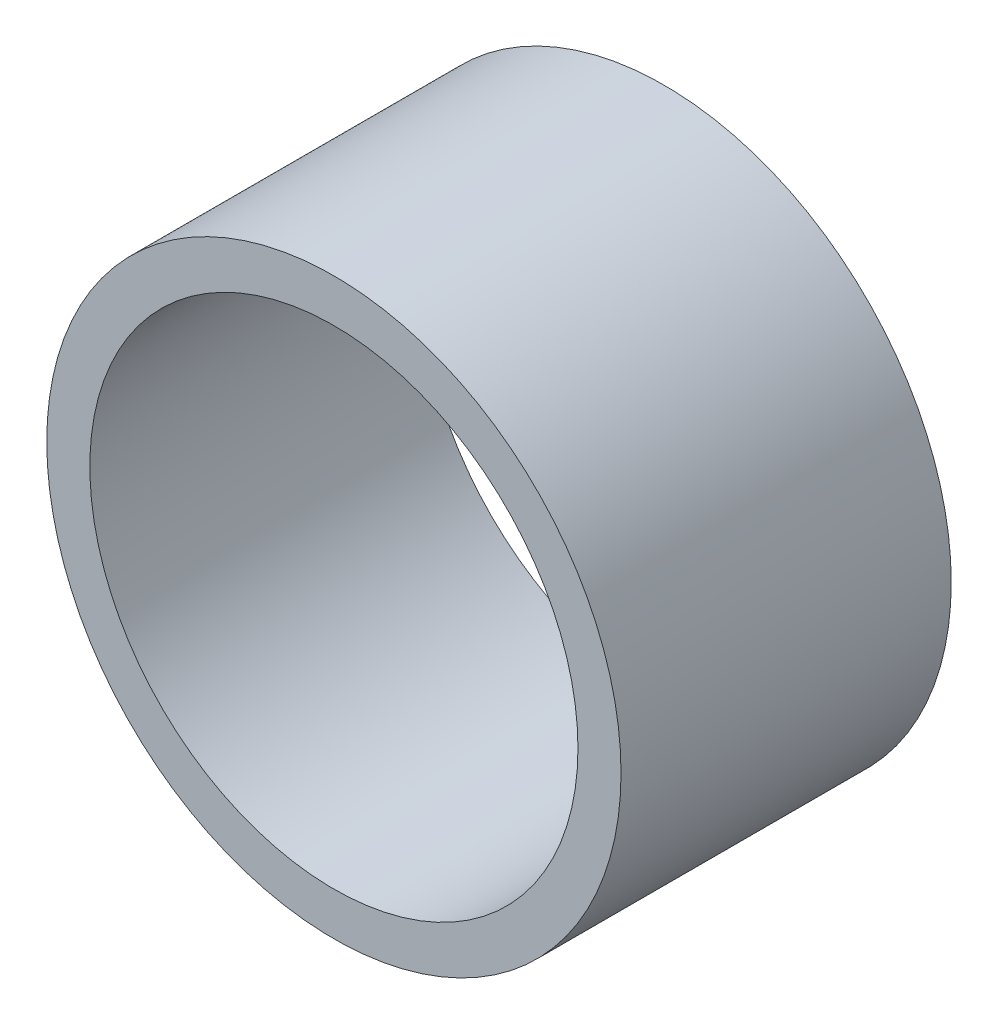
ISO-10303-21;
HEADER;
FILE_DESCRIPTION(('STEP AP214'),'2;1');
FILE_NAME('part.step','',(''),(''),'','','');
FILE_SCHEMA(('AUTOMOTIVE_DESIGN { 1 0 10303 214 1 1 1 1 }'));
ENDSEC;
DATA;
#1=APPLICATION_CONTEXT('core data for automotive mechanical design processes');
#2=APPLICATION_PROTOCOL_DEFINITION('international standard','automotive_design',2000,#1);
#3=PRODUCT_CONTEXT('',#1,'mechanical');
#4=PRODUCT('Part','Part','',(#3));
#5=PRODUCT_RELATED_PRODUCT_CATEGORY('part','',(#4));
#6=PRODUCT_DEFINITION_FORMATION('','',#4);
#7=PRODUCT_DEFINITION_CONTEXT('part definition',#1,'design');
#8=PRODUCT_DEFINITION('design','',#6,#7);
#9=PRODUCT_DEFINITION_SHAPE('','',#8);
#10=(LENGTH_UNIT() NAMED_UNIT(*) SI_UNIT(.MILLI.,.METRE.));
#11=(NAMED_UNIT(*) PLANE_ANGLE_UNIT() SI_UNIT($,.RADIAN.));
#12=(NAMED_UNIT(*) SI_UNIT($,.STERADIAN.) SOLID_ANGLE_UNIT());
#13=UNCERTAINTY_MEASURE_WITH_UNIT(LENGTH_MEASURE(1.E-05),#10,'distance_accuracy_value','');
#14=(GEOMETRIC_REPRESENTATION_CONTEXT(3) GLOBAL_UNCERTAINTY_ASSIGNED_CONTEXT((#13)) GLOBAL_UNIT_ASSIGNED_CONTEXT((#10,
#11,#12)) REPRESENTATION_CONTEXT('',''));
#15=CARTESIAN_POINT('',(0.,0.,0.));
#16=DIRECTION('',(0.,0.,1.));
#17=DIRECTION('',(1.,0.,0.));
#18=AXIS2_PLACEMENT_3D('',#15,#16,#17);
#19=CARTESIAN_POINT('',(0.,0.,17.));
#20=DIRECTION('',(0.,0.,1.));
#21=DIRECTION('',(1.,0.,0.));
#22=AXIS2_PLACEMENT_3D('',#19,#20,#21);
#23=PLANE('',#22);
#24=CARTESIAN_POINT('',(0.,0.,17.));
#25=DIRECTION('',(0.,0.,1.));
#26=DIRECTION('',(1.,0.,0.));
#27=AXIS2_PLACEMENT_3D('',#24,#25,#26);
#28=CIRCLE('',#27,15.);
#29=CARTESIAN_POINT('',(15.,0.,17.));
#30=VERTEX_POINT('',#29);
#31=EDGE_CURVE('E11',#30,#30,#28,.T.);
#32=ORIENTED_EDGE('',*,*,#31,.T.);
#33=EDGE_LOOP('',(#32));
#34=FACE_BOUND('',#33,.T.);
#35=CARTESIAN_POINT('',(0.,0.,17.));
#36=DIRECTION('',(0.,0.,1.));
#37=DIRECTION('',(1.,0.,0.));
#38=AXIS2_PLACEMENT_3D('',#35,#36,#37);
#39=CIRCLE('',#38,12.75);
#40=CARTESIAN_POINT('',(12.75,0.,17.));
#41=VERTEX_POINT('',#40);
#42=EDGE_CURVE('E41',#41,#41,#39,.T.);
#43=ORIENTED_EDGE('',*,*,#42,.F.);
#44=EDGE_LOOP('',(#43));
#45=FACE_BOUND('',#44,.T.);
#46=ADVANCED_FACE('F33',(#34,#45),#23,.T.);
#47=CARTESIAN_POINT('',(0.,0.,17.));
#48=DIRECTION('',(0.,0.,-1.));
#49=DIRECTION('',(-1.,0.,0.));
#50=AXIS2_PLACEMENT_3D('',#47,#48,#49);
#51=CYLINDRICAL_SURFACE('',#50,15.);
#52=ORIENTED_EDGE('',*,*,#31,.F.);
#53=EDGE_LOOP('',(#52));
#54=FACE_BOUND('',#53,.T.);
#55=CARTESIAN_POINT('',(0.,0.,-0.25));
#56=DIRECTION('',(0.,0.,1.));
#57=DIRECTION('',(1.,0.,0.));
#58=AXIS2_PLACEMENT_3D('',#55,#56,#57);
#59=CIRCLE('',#58,15.);
#60=CARTESIAN_POINT('',(15.,0.,-0.25));
#61=VERTEX_POINT('',#60);
#62=EDGE_CURVE('E490',#61,#61,#59,.T.);
#63=ORIENTED_EDGE('',*,*,#62,.T.);
#64=EDGE_LOOP('',(#63));
#65=FACE_BOUND('',#64,.T.);
#66=ADVANCED_FACE('F35',(#54,#65),#51,.T.);
#67=CARTESIAN_POINT('',(0.,0.,17.));
#68=DIRECTION('',(0.,0.,-1.));
#69=DIRECTION('',(-1.,0.,0.));
#70=AXIS2_PLACEMENT_3D('',#67,#68,#69);
#71=CYLINDRICAL_SURFACE('',#70,12.75);
#72=ORIENTED_EDGE('',*,*,#42,.T.);
#73=EDGE_LOOP('',(#72));
#74=FACE_BOUND('',#73,.T.);
#75=CARTESIAN_POINT('',(0.,0.,0.));
#76=DIRECTION('',(0.,0.,1.));
#77=DIRECTION('',(1.,0.,0.));
#78=AXIS2_PLACEMENT_3D('',#75,#76,#77);
#79=CIRCLE('',#78,12.75);
#80=CARTESIAN_POINT('',(-12.7401923062409,0.5,0.));
#81=VERTEX_POINT('',#80);
#82=CARTESIAN_POINT('',(-12.7401923062409,-0.499999999999999,0.));
#83=VERTEX_POINT('',#82);
#84=EDGE_CURVE('E56',#81,#83,#79,.T.);
#85=ORIENTED_EDGE('',*,*,#84,.F.);
#86=DIRECTION('',(0.,0.,1.));
#87=VECTOR('',#86,1.);
#88=CARTESIAN_POINT('',(-12.7401923062409,0.5,-0.25));
#89=LINE('',#88,#87);
#90=CARTESIAN_POINT('',(-12.7401923062409,0.5,-0.25));
#91=VERTEX_POINT('',#90);
#92=EDGE_CURVE('E495',#91,#81,#89,.T.);
#93=ORIENTED_EDGE('',*,*,#92,.F.);
#94=CARTESIAN_POINT('',(0.,0.,-0.25));
#95=DIRECTION('',(0.,0.,1.));
#96=DIRECTION('',(-1.,0.,0.));
#97=AXIS2_PLACEMENT_3D('',#94,#95,#96);
#98=CIRCLE('',#97,12.75);
#99=CARTESIAN_POINT('',(12.7401923062409,0.500000000000003,-0.25));
#100=VERTEX_POINT('',#99);
#101=EDGE_CURVE('E457',#100,#91,#98,.T.);
#102=ORIENTED_EDGE('',*,*,#101,.F.);
#103=DIRECTION('',(0.,0.,1.));
#104=VECTOR('',#103,1.);
#105=CARTESIAN_POINT('',(12.7401923062409,0.500000000000003,-0.25));
#106=LINE('',#105,#104);
#107=CARTESIAN_POINT('',(12.7401923062409,0.500000000000003,0.));
#108=VERTEX_POINT('',#107);
#109=EDGE_CURVE('E498',#100,#108,#106,.T.);
#110=ORIENTED_EDGE('',*,*,#109,.T.);
#111=CARTESIAN_POINT('',(12.7401923062409,-0.499999999999997,0.));
#112=VERTEX_POINT('',#111);
#113=EDGE_CURVE('E48',#112,#108,#79,.T.);
#114=ORIENTED_EDGE('',*,*,#113,.F.);
#115=DIRECTION('',(0.,0.,1.));
#116=VECTOR('',#115,1.);
#117=CARTESIAN_POINT('',(12.7401923062409,-0.499999999999997,-0.25));
#118=LINE('',#117,#116);
#119=CARTESIAN_POINT('',(12.7401923062409,-0.499999999999997,-0.25));
#120=VERTEX_POINT('',#119);
#121=EDGE_CURVE('E309',#120,#112,#118,.T.);
#122=ORIENTED_EDGE('',*,*,#121,.F.);
#123=CARTESIAN_POINT('',(0.,0.,-0.25));
#124=DIRECTION('',(0.,0.,1.));
#125=DIRECTION('',(1.,0.,0.));
#126=AXIS2_PLACEMENT_3D('',#123,#124,#125);
#127=CIRCLE('',#126,12.75);
#128=CARTESIAN_POINT('',(-12.7401923062409,-0.499999999999999,-0.25));
#129=VERTEX_POINT('',#128);
#130=EDGE_CURVE('E279',#129,#120,#127,.T.);
#131=ORIENTED_EDGE('',*,*,#130,.F.);
#132=DIRECTION('',(0.,0.,1.));
#133=VECTOR('',#132,1.);
#134=CARTESIAN_POINT('',(-12.7401923062409,-0.499999999999999,-0.25));
#135=LINE('',#134,#133);
#136=EDGE_CURVE('E311',#129,#83,#135,.T.);
#137=ORIENTED_EDGE('',*,*,#136,.T.);
#138=EDGE_LOOP('',(#85,#93,#102,#110,#114,#122,#131,#137));
#139=FACE_BOUND('',#138,.T.);
#140=ADVANCED_FACE('F515',(#74,#139),#71,.F.);
#141=CARTESIAN_POINT('',(0.,0.,0.));
#142=DIRECTION('',(0.,0.,1.));
#143=DIRECTION('',(1.,0.,0.));
#144=AXIS2_PLACEMENT_3D('',#141,#142,#143);
#145=PLANE('',#144);
#146=CARTESIAN_POINT('',(0.,0.,0.));
#147=DIRECTION('',(0.,0.,-1.));
#148=DIRECTION('',(1.,0.,0.));
#149=AXIS2_PLACEMENT_3D('',#146,#147,#148);
#150=CIRCLE('',#149,5.);
#151=CARTESIAN_POINT('',(-0.499999999999998,-4.9749371855331,0.));
#152=VERTEX_POINT('',#151);
#153=CARTESIAN_POINT('',(-0.499999999999998,4.9749371855331,0.));
#154=VERTEX_POINT('',#153);
#155=EDGE_CURVE('E365',#152,#154,#150,.T.);
#156=ORIENTED_EDGE('',*,*,#155,.F.);
#157=DIRECTION('',(0.,1.,0.));
#158=VECTOR('',#157,1.);
#159=CARTESIAN_POINT('',(-0.499999999999998,-4.9749371855331,0.));
#160=LINE('',#159,#158);
#161=CARTESIAN_POINT('',(-0.499999999999997,-8.86090429922364,0.));
#162=VERTEX_POINT('',#161);
#163=EDGE_CURVE('E384',#162,#152,#160,.T.);
#164=ORIENTED_EDGE('',*,*,#163,.F.);
#165=DIRECTION('',(1.,0.,0.));
#166=VECTOR('',#165,1.);
#167=CARTESIAN_POINT('',(-0.499999999999997,-8.86090429922364,0.));
#168=LINE('',#167,#166);
#169=CARTESIAN_POINT('',(-0.999999999999997,-8.86090429922364,0.));
#170=VERTEX_POINT('',#169);
#171=EDGE_CURVE('E422',#170,#162,#168,.T.);
#172=ORIENTED_EDGE('',*,*,#171,.F.);
#173=DIRECTION('',(0.,-1.,0.));
#174=VECTOR('',#173,1.);
#175=CARTESIAN_POINT('',(-0.999999999999997,-8.86090429922364,0.));
#176=LINE('',#175,#174);
#177=CARTESIAN_POINT('',(-1.,-7.30688887283774,0.));
#178=VERTEX_POINT('',#177);
#179=EDGE_CURVE('E419',#178,#170,#176,.T.);
#180=ORIENTED_EDGE('',*,*,#179,.F.);
#181=CARTESIAN_POINT('',(0.,0.,0.));
#182=DIRECTION('',(0.,0.,1.));
#183=DIRECTION('',(1.,0.,0.));
#184=AXIS2_PLACEMENT_3D('',#181,#182,#183);
#185=CIRCLE('',#184,7.375);
#186=CARTESIAN_POINT('',(-0.999999999999997,7.30688887283774,0.));
#187=VERTEX_POINT('',#186);
#188=EDGE_CURVE('E416',#187,#178,#185,.T.);
#189=ORIENTED_EDGE('',*,*,#188,.F.);
#190=DIRECTION('',(0.,-1.,0.));
#191=VECTOR('',#190,1.);
#192=CARTESIAN_POINT('',(-0.999999999999999,8.86090429922364,0.));
#193=LINE('',#192,#191);
#194=CARTESIAN_POINT('',(-0.999999999999999,8.86090429922364,0.));
#195=VERTEX_POINT('',#194);
#196=EDGE_CURVE('E413',#195,#187,#193,.T.);
#197=ORIENTED_EDGE('',*,*,#196,.F.);
#198=DIRECTION('',(-1.,0.,0.));
#199=VECTOR('',#198,1.);
#200=CARTESIAN_POINT('',(-0.499999999999999,8.86090429922364,0.));
#201=LINE('',#200,#199);
#202=CARTESIAN_POINT('',(-0.499999999999999,8.86090429922364,0.));
#203=VERTEX_POINT('',#202);
#204=EDGE_CURVE('E410',#203,#195,#201,.T.);
#205=ORIENTED_EDGE('',*,*,#204,.F.);
#206=DIRECTION('',(0.,1.,0.));
#207=VECTOR('',#206,1.);
#208=CARTESIAN_POINT('',(-0.499999999999998,4.9749371855331,0.));
#209=LINE('',#208,#207);
#210=EDGE_CURVE('E407',#154,#203,#209,.T.);
#211=ORIENTED_EDGE('',*,*,#210,.F.);
#212=EDGE_LOOP('',(#156,#164,#172,#180,#189,#197,#205,#211));
#213=FACE_BOUND('',#212,.T.);
#214=CARTESIAN_POINT('',(0.,0.,0.));
#215=DIRECTION('',(0.,0.,-1.));
#216=DIRECTION('',(-1.,0.,0.));
#217=AXIS2_PLACEMENT_3D('',#214,#215,#216);
#218=CIRCLE('',#217,4.99999999999486);
#219=CARTESIAN_POINT('',(0.499999999999999,4.97493718552794,0.));
#220=VERTEX_POINT('',#219);
#221=CARTESIAN_POINT('',(0.499999999999998,-4.97493718552794,0.));
#222=VERTEX_POINT('',#221);
#223=EDGE_CURVE('E304',#220,#222,#218,.T.);
#224=ORIENTED_EDGE('',*,*,#223,.F.);
#225=DIRECTION('',(0.,-1.,0.));
#226=VECTOR('',#225,1.);
#227=CARTESIAN_POINT('',(0.500000000000001,8.86090429922364,0.));
#228=LINE('',#227,#226);
#229=CARTESIAN_POINT('',(0.500000000000001,8.86090429922364,0.));
#230=VERTEX_POINT('',#229);
#231=EDGE_CURVE('E320',#230,#220,#228,.T.);
#232=ORIENTED_EDGE('',*,*,#231,.F.);
#233=DIRECTION('',(-1.,0.,0.));
#234=VECTOR('',#233,1.);
#235=CARTESIAN_POINT('',(1.,8.86090429922364,0.));
#236=LINE('',#235,#234);
#237=CARTESIAN_POINT('',(1.,8.86090429922364,0.));
#238=VERTEX_POINT('',#237);
#239=EDGE_CURVE('E358',#238,#230,#236,.T.);
#240=ORIENTED_EDGE('',*,*,#239,.F.);
#241=DIRECTION('',(0.,1.,0.));
#242=VECTOR('',#241,1.);
#243=CARTESIAN_POINT('',(0.999999999999999,7.30688887284244,0.));
#244=LINE('',#243,#242);
#245=CARTESIAN_POINT('',(0.999999999999999,7.30688887284244,0.));
#246=VERTEX_POINT('',#245);
#247=EDGE_CURVE('E355',#246,#238,#244,.T.);
#248=ORIENTED_EDGE('',*,*,#247,.F.);
#249=CARTESIAN_POINT('',(0.,0.,0.));
#250=DIRECTION('',(0.,0.,1.));
#251=DIRECTION('',(-1.,0.,0.));
#252=AXIS2_PLACEMENT_3D('',#249,#250,#251);
#253=CIRCLE('',#252,7.37500000000465);
#254=CARTESIAN_POINT('',(0.999999999999996,-7.30688887284244,0.));
#255=VERTEX_POINT('',#254);
#256=EDGE_CURVE('E352',#255,#246,#253,.T.);
#257=ORIENTED_EDGE('',*,*,#256,.F.);
#258=DIRECTION('',(0.,1.,0.));
#259=VECTOR('',#258,1.);
#260=CARTESIAN_POINT('',(1.,-8.86090429922364,0.));
#261=LINE('',#260,#259);
#262=CARTESIAN_POINT('',(1.,-8.86090429922364,0.));
#263=VERTEX_POINT('',#262);
#264=EDGE_CURVE('E349',#263,#255,#261,.T.);
#265=ORIENTED_EDGE('',*,*,#264,.F.);
#266=DIRECTION('',(1.,0.,0.));
#267=VECTOR('',#266,1.);
#268=CARTESIAN_POINT('',(0.499999999999997,-8.86090429922364,0.));
#269=LINE('',#268,#267);
#270=CARTESIAN_POINT('',(0.499999999999997,-8.86090429922364,0.));
#271=VERTEX_POINT('',#270);
#272=EDGE_CURVE('E346',#271,#263,#269,.T.);
#273=ORIENTED_EDGE('',*,*,#272,.F.);
#274=DIRECTION('',(0.,-1.,0.));
#275=VECTOR('',#274,1.);
#276=CARTESIAN_POINT('',(0.499999999999998,-4.97493718552794,0.));
#277=LINE('',#276,#275);
#278=EDGE_CURVE('E343',#222,#271,#277,.T.);
#279=ORIENTED_EDGE('',*,*,#278,.F.);
#280=EDGE_LOOP('',(#224,#232,#240,#248,#257,#265,#273,#279));
#281=FACE_BOUND('',#280,.T.);
#282=DIRECTION('',(1.,0.,0.));
#283=VECTOR('',#282,1.);
#284=CARTESIAN_POINT('',(-12.7401923062409,0.5,0.));
#285=LINE('',#284,#283);
#286=CARTESIAN_POINT('',(-8.86090429922364,0.5,0.));
#287=VERTEX_POINT('',#286);
#288=EDGE_CURVE('E480',#81,#287,#285,.T.);
#289=ORIENTED_EDGE('',*,*,#288,.F.);
#290=ORIENTED_EDGE('',*,*,#84,.T.);
#291=DIRECTION('',(-1.,0.,0.));
#292=VECTOR('',#291,1.);
#293=CARTESIAN_POINT('',(-12.7401923062409,-0.5,0.));
#294=LINE('',#293,#292);
#295=CARTESIAN_POINT('',(-8.86090429922364,-0.5,0.));
#296=VERTEX_POINT('',#295);
#297=EDGE_CURVE('E294',#296,#83,#294,.T.);
#298=ORIENTED_EDGE('',*,*,#297,.F.);
#299=DIRECTION('',(0.,1.,0.));
#300=VECTOR('',#299,1.);
#301=CARTESIAN_POINT('',(-8.86090429922364,-0.5,0.));
#302=LINE('',#301,#300);
#303=CARTESIAN_POINT('',(-8.86090429922364,-1.,0.));
#304=VERTEX_POINT('',#303);
#305=EDGE_CURVE('E291',#304,#296,#302,.T.);
#306=ORIENTED_EDGE('',*,*,#305,.F.);
#307=DIRECTION('',(1.,0.,0.));
#308=VECTOR('',#307,1.);
#309=CARTESIAN_POINT('',(-8.86090429922364,-1.,0.));
#310=LINE('',#309,#308);
#311=CARTESIAN_POINT('',(-10.3266947761614,-1.,0.));
#312=VERTEX_POINT('',#311);
#313=EDGE_CURVE('E289',#312,#304,#310,.T.);
#314=ORIENTED_EDGE('',*,*,#313,.F.);
#315=CARTESIAN_POINT('',(0.,0.,0.));
#316=DIRECTION('',(0.,0.,-1.));
#317=DIRECTION('',(-1.,0.,0.));
#318=AXIS2_PLACEMENT_3D('',#315,#316,#317);
#319=CIRCLE('',#318,10.375);
#320=CARTESIAN_POINT('',(10.3266947761614,-0.999999999999997,0.));
#321=VERTEX_POINT('',#320);
#322=EDGE_CURVE('E250',#321,#312,#319,.T.);
#323=ORIENTED_EDGE('',*,*,#322,.F.);
#324=DIRECTION('',(1.,0.,0.));
#325=VECTOR('',#324,1.);
#326=CARTESIAN_POINT('',(8.86090429922364,-0.999999999999998,0.));
#327=LINE('',#326,#325);
#328=CARTESIAN_POINT('',(8.86090429922364,-0.999999999999998,0.));
#329=VERTEX_POINT('',#328);
#330=EDGE_CURVE('E269',#329,#321,#327,.T.);
#331=ORIENTED_EDGE('',*,*,#330,.F.);
#332=DIRECTION('',(0.,-1.,0.));
#333=VECTOR('',#332,1.);
#334=CARTESIAN_POINT('',(8.86090429922364,-0.5,0.));
#335=LINE('',#334,#333);
#336=CARTESIAN_POINT('',(8.86090429922364,-0.5,0.));
#337=VERTEX_POINT('',#336);
#338=EDGE_CURVE('E272',#337,#329,#335,.T.);
#339=ORIENTED_EDGE('',*,*,#338,.F.);
#340=DIRECTION('',(-1.,0.,0.));
#341=VECTOR('',#340,1.);
#342=CARTESIAN_POINT('',(12.7401923062409,-0.499999999999997,0.));
#343=LINE('',#342,#341);
#344=EDGE_CURVE('E297',#112,#337,#343,.T.);
#345=ORIENTED_EDGE('',*,*,#344,.F.);
#346=ORIENTED_EDGE('',*,*,#113,.T.);
#347=DIRECTION('',(1.,0.,0.));
#348=VECTOR('',#347,1.);
#349=CARTESIAN_POINT('',(12.7401923062409,0.500000000000003,0.));
#350=LINE('',#349,#348);
#351=CARTESIAN_POINT('',(8.86090429922364,0.5,0.));
#352=VERTEX_POINT('',#351);
#353=EDGE_CURVE('E477',#352,#108,#350,.T.);
#354=ORIENTED_EDGE('',*,*,#353,.F.);
#355=DIRECTION('',(0.,-1.,0.));
#356=VECTOR('',#355,1.);
#357=CARTESIAN_POINT('',(8.86090429922364,0.5,0.));
#358=LINE('',#357,#356);
#359=CARTESIAN_POINT('',(8.86090429922364,1.,0.));
#360=VERTEX_POINT('',#359);
#361=EDGE_CURVE('E474',#360,#352,#358,.T.);
#362=ORIENTED_EDGE('',*,*,#361,.F.);
#363=DIRECTION('',(-1.,0.,0.));
#364=VECTOR('',#363,1.);
#365=CARTESIAN_POINT('',(8.86090429922364,1.,0.));
#366=LINE('',#365,#364);
#367=CARTESIAN_POINT('',(10.3266947761614,1.,0.));
#368=VERTEX_POINT('',#367);
#369=EDGE_CURVE('E471',#368,#360,#366,.T.);
#370=ORIENTED_EDGE('',*,*,#369,.F.);
#371=CARTESIAN_POINT('',(0.,0.,0.));
#372=DIRECTION('',(0.,0.,-1.));
#373=DIRECTION('',(1.,0.,0.));
#374=AXIS2_PLACEMENT_3D('',#371,#372,#373);
#375=CIRCLE('',#374,10.375);
#376=CARTESIAN_POINT('',(-10.3266947761614,1.,0.));
#377=VERTEX_POINT('',#376);
#378=EDGE_CURVE('E429',#377,#368,#375,.T.);
#379=ORIENTED_EDGE('',*,*,#378,.F.);
#380=DIRECTION('',(-1.,0.,0.));
#381=VECTOR('',#380,1.);
#382=CARTESIAN_POINT('',(-8.86090429922364,1.,0.));
#383=LINE('',#382,#381);
#384=CARTESIAN_POINT('',(-8.86090429922364,1.,0.));
#385=VERTEX_POINT('',#384);
#386=EDGE_CURVE('E448',#385,#377,#383,.T.);
#387=ORIENTED_EDGE('',*,*,#386,.F.);
#388=DIRECTION('',(0.,1.,0.));
#389=VECTOR('',#388,1.);
#390=CARTESIAN_POINT('',(-8.86090429922364,0.5,0.));
#391=LINE('',#390,#389);
#392=EDGE_CURVE('E483',#287,#385,#391,.T.);
#393=ORIENTED_EDGE('',*,*,#392,.F.);
#394=EDGE_LOOP('',(#289,#290,#298,#306,#314,#323,#331,#339,#345,#346,#354,#362,#370,#379,#387,#393));
#395=FACE_BOUND('',#394,.T.);
#396=ADVANCED_FACE('F511',(#213,#281,#395),#145,.T.);
#397=CARTESIAN_POINT('',(0.,0.,-0.25));
#398=DIRECTION('',(0.,0.,1.));
#399=DIRECTION('',(1.,0.,0.));
#400=AXIS2_PLACEMENT_3D('',#397,#398,#399);
#401=PLANE('',#400);
#402=DIRECTION('',(1.,0.,0.));
#403=VECTOR('',#402,1.);
#404=CARTESIAN_POINT('',(8.86090429922364,-0.999999999999998,-0.25));
#405=LINE('',#404,#403);
#406=CARTESIAN_POINT('',(8.86090429922364,-0.999999999999998,-0.25));
#407=VERTEX_POINT('',#406);
#408=CARTESIAN_POINT('',(10.3266947761614,-0.999999999999997,-0.25));
#409=VERTEX_POINT('',#408);
#410=EDGE_CURVE('E255',#407,#409,#405,.T.);
#411=ORIENTED_EDGE('',*,*,#410,.T.);
#412=CARTESIAN_POINT('',(0.,0.,-0.25));
#413=DIRECTION('',(0.,0.,-1.));
#414=DIRECTION('',(-1.,0.,0.));
#415=AXIS2_PLACEMENT_3D('',#412,#413,#414);
#416=CIRCLE('',#415,10.375);
#417=CARTESIAN_POINT('',(-10.3266947761614,-1.,-0.25));
#418=VERTEX_POINT('',#417);
#419=EDGE_CURVE('E247',#409,#418,#416,.T.);
#420=ORIENTED_EDGE('',*,*,#419,.T.);
#421=DIRECTION('',(1.,0.,0.));
#422=VECTOR('',#421,1.);
#423=CARTESIAN_POINT('',(-8.86090429922364,-1.,-0.25));
#424=LINE('',#423,#422);
#425=CARTESIAN_POINT('',(-8.86090429922364,-1.,-0.25));
#426=VERTEX_POINT('',#425);
#427=EDGE_CURVE('E259',#418,#426,#424,.T.);
#428=ORIENTED_EDGE('',*,*,#427,.T.);
#429=DIRECTION('',(0.,1.,0.));
#430=VECTOR('',#429,1.);
#431=CARTESIAN_POINT('',(-8.86090429922364,-0.5,-0.25));
#432=LINE('',#431,#430);
#433=CARTESIAN_POINT('',(-8.86090429922364,-0.5,-0.25));
#434=VERTEX_POINT('',#433);
#435=EDGE_CURVE('E263',#426,#434,#432,.T.);
#436=ORIENTED_EDGE('',*,*,#435,.T.);
#437=DIRECTION('',(-1.,0.,0.));
#438=VECTOR('',#437,1.);
#439=CARTESIAN_POINT('',(-12.7401923062409,-0.5,-0.25));
#440=LINE('',#439,#438);
#441=EDGE_CURVE('E276',#434,#129,#440,.T.);
#442=ORIENTED_EDGE('',*,*,#441,.T.);
#443=ORIENTED_EDGE('',*,*,#130,.T.);
#444=DIRECTION('',(-1.,0.,0.));
#445=VECTOR('',#444,1.);
#446=CARTESIAN_POINT('',(12.7401923062409,-0.499999999999997,-0.25));
#447=LINE('',#446,#445);
#448=CARTESIAN_POINT('',(8.86090429922364,-0.5,-0.25));
#449=VERTEX_POINT('',#448);
#450=EDGE_CURVE('E282',#120,#449,#447,.T.);
#451=ORIENTED_EDGE('',*,*,#450,.T.);
#452=DIRECTION('',(0.,-1.,0.));
#453=VECTOR('',#452,1.);
#454=CARTESIAN_POINT('',(8.86090429922364,-0.5,-0.25));
#455=LINE('',#454,#453);
#456=EDGE_CURVE('E285',#449,#407,#455,.T.);
#457=ORIENTED_EDGE('',*,*,#456,.T.);
#458=EDGE_LOOP('',(#411,#420,#428,#436,#442,#443,#451,#457));
#459=FACE_BOUND('',#458,.T.);
#460=DIRECTION('',(0.,-1.,0.));
#461=VECTOR('',#460,1.);
#462=CARTESIAN_POINT('',(0.500000000000001,8.86090429922364,-0.25));
#463=LINE('',#462,#461);
#464=CARTESIAN_POINT('',(0.500000000000001,8.86090429922364,-0.25));
#465=VERTEX_POINT('',#464);
#466=CARTESIAN_POINT('',(0.499999999999999,4.97493718552794,-0.25));
#467=VERTEX_POINT('',#466);
#468=EDGE_CURVE('E338',#465,#467,#463,.T.);
#469=ORIENTED_EDGE('',*,*,#468,.T.);
#470=CARTESIAN_POINT('',(0.,0.,-0.25));
#471=DIRECTION('',(0.,0.,-1.));
#472=DIRECTION('',(-1.,0.,0.));
#473=AXIS2_PLACEMENT_3D('',#470,#471,#472);
#474=CIRCLE('',#473,4.99999999999486);
#475=CARTESIAN_POINT('',(0.499999999999998,-4.97493718552794,-0.25));
#476=VERTEX_POINT('',#475);
#477=EDGE_CURVE('E316',#467,#476,#474,.T.);
#478=ORIENTED_EDGE('',*,*,#477,.T.);
#479=DIRECTION('',(0.,-1.,0.));
#480=VECTOR('',#479,1.);
#481=CARTESIAN_POINT('',(0.499999999999998,-4.97493718552794,-0.25));
#482=LINE('',#481,#480);
#483=CARTESIAN_POINT('',(0.499999999999997,-8.86090429922364,-0.25));
#484=VERTEX_POINT('',#483);
#485=EDGE_CURVE('E319',#476,#484,#482,.T.);
#486=ORIENTED_EDGE('',*,*,#485,.T.);
#487=DIRECTION('',(1.,0.,0.));
#488=VECTOR('',#487,1.);
#489=CARTESIAN_POINT('',(0.499999999999997,-8.86090429922364,-0.25));
#490=LINE('',#489,#488);
#491=CARTESIAN_POINT('',(1.,-8.86090429922364,-0.25));
#492=VERTEX_POINT('',#491);
#493=EDGE_CURVE('E323',#484,#492,#490,.T.);
#494=ORIENTED_EDGE('',*,*,#493,.T.);
#495=DIRECTION('',(0.,1.,0.));
#496=VECTOR('',#495,1.);
#497=CARTESIAN_POINT('',(1.,-8.86090429922364,-0.25));
#498=LINE('',#497,#496);
#499=CARTESIAN_POINT('',(0.999999999999996,-7.30688887284244,-0.25));
#500=VERTEX_POINT('',#499);
#501=EDGE_CURVE('E326',#492,#500,#498,.T.);
#502=ORIENTED_EDGE('',*,*,#501,.T.);
#503=CARTESIAN_POINT('',(0.,0.,-0.25));
#504=DIRECTION('',(0.,0.,1.));
#505=DIRECTION('',(-1.,0.,0.));
#506=AXIS2_PLACEMENT_3D('',#503,#504,#505);
#507=CIRCLE('',#506,7.37500000000465);
#508=CARTESIAN_POINT('',(0.999999999999999,7.30688887284244,-0.25));
#509=VERTEX_POINT('',#508);
#510=EDGE_CURVE('E329',#500,#509,#507,.T.);
#511=ORIENTED_EDGE('',*,*,#510,.T.);
#512=DIRECTION('',(0.,1.,0.));
#513=VECTOR('',#512,1.);
#514=CARTESIAN_POINT('',(0.999999999999999,7.30688887284244,-0.25));
#515=LINE('',#514,#513);
#516=CARTESIAN_POINT('',(1.,8.86090429922364,-0.25));
#517=VERTEX_POINT('',#516);
#518=EDGE_CURVE('E332',#509,#517,#515,.T.);
#519=ORIENTED_EDGE('',*,*,#518,.T.);
#520=DIRECTION('',(-1.,0.,0.));
#521=VECTOR('',#520,1.);
#522=CARTESIAN_POINT('',(1.,8.86090429922364,-0.25));
#523=LINE('',#522,#521);
#524=EDGE_CURVE('E335',#517,#465,#523,.T.);
#525=ORIENTED_EDGE('',*,*,#524,.T.);
#526=EDGE_LOOP('',(#469,#478,#486,#494,#502,#511,#519,#525));
#527=FACE_BOUND('',#526,.T.);
#528=DIRECTION('',(0.,1.,0.));
#529=VECTOR('',#528,1.);
#530=CARTESIAN_POINT('',(-0.499999999999998,-4.9749371855331,-0.25));
#531=LINE('',#530,#529);
#532=CARTESIAN_POINT('',(-0.499999999999997,-8.86090429922364,-0.25));
#533=VERTEX_POINT('',#532);
#534=CARTESIAN_POINT('',(-0.499999999999998,-4.9749371855331,-0.25));
#535=VERTEX_POINT('',#534);
#536=EDGE_CURVE('E402',#533,#535,#531,.T.);
#537=ORIENTED_EDGE('',*,*,#536,.T.);
#538=CARTESIAN_POINT('',(0.,0.,-0.25));
#539=DIRECTION('',(0.,0.,-1.));
#540=DIRECTION('',(1.,0.,0.));
#541=AXIS2_PLACEMENT_3D('',#538,#539,#540);
#542=CIRCLE('',#541,5.);
#543=CARTESIAN_POINT('',(-0.499999999999998,4.9749371855331,-0.25));
#544=VERTEX_POINT('',#543);
#545=EDGE_CURVE('E380',#535,#544,#542,.T.);
#546=ORIENTED_EDGE('',*,*,#545,.T.);
#547=DIRECTION('',(0.,1.,0.));
#548=VECTOR('',#547,1.);
#549=CARTESIAN_POINT('',(-0.499999999999998,4.9749371855331,-0.25));
#550=LINE('',#549,#548);
#551=CARTESIAN_POINT('',(-0.499999999999999,8.86090429922364,-0.25));
#552=VERTEX_POINT('',#551);
#553=EDGE_CURVE('E383',#544,#552,#550,.T.);
#554=ORIENTED_EDGE('',*,*,#553,.T.);
#555=DIRECTION('',(-1.,0.,0.));
#556=VECTOR('',#555,1.);
#557=CARTESIAN_POINT('',(-0.499999999999999,8.86090429922364,-0.25));
#558=LINE('',#557,#556);
#559=CARTESIAN_POINT('',(-0.999999999999999,8.86090429922364,-0.25));
#560=VERTEX_POINT('',#559);
#561=EDGE_CURVE('E387',#552,#560,#558,.T.);
#562=ORIENTED_EDGE('',*,*,#561,.T.);
#563=DIRECTION('',(0.,-1.,0.));
#564=VECTOR('',#563,1.);
#565=CARTESIAN_POINT('',(-0.999999999999999,8.86090429922364,-0.25));
#566=LINE('',#565,#564);
#567=CARTESIAN_POINT('',(-0.999999999999997,7.30688887283774,-0.25));
#568=VERTEX_POINT('',#567);
#569=EDGE_CURVE('E390',#560,#568,#566,.T.);
#570=ORIENTED_EDGE('',*,*,#569,.T.);
#571=CARTESIAN_POINT('',(0.,0.,-0.25));
#572=DIRECTION('',(0.,0.,1.));
#573=DIRECTION('',(1.,0.,0.));
#574=AXIS2_PLACEMENT_3D('',#571,#572,#573);
#575=CIRCLE('',#574,7.375);
#576=CARTESIAN_POINT('',(-1.,-7.30688887283774,-0.25));
#577=VERTEX_POINT('',#576);
#578=EDGE_CURVE('E393',#568,#577,#575,.T.);
#579=ORIENTED_EDGE('',*,*,#578,.T.);
#580=DIRECTION('',(0.,-1.,0.));
#581=VECTOR('',#580,1.);
#582=CARTESIAN_POINT('',(-0.999999999999997,-8.86090429922364,-0.25));
#583=LINE('',#582,#581);
#584=CARTESIAN_POINT('',(-0.999999999999997,-8.86090429922364,-0.25));
#585=VERTEX_POINT('',#584);
#586=EDGE_CURVE('E396',#577,#585,#583,.T.);
#587=ORIENTED_EDGE('',*,*,#586,.T.);
#588=DIRECTION('',(1.,0.,0.));
#589=VECTOR('',#588,1.);
#590=CARTESIAN_POINT('',(-0.499999999999997,-8.86090429922364,-0.25));
#591=LINE('',#590,#589);
#592=EDGE_CURVE('E399',#585,#533,#591,.T.);
#593=ORIENTED_EDGE('',*,*,#592,.T.);
#594=EDGE_LOOP('',(#537,#546,#554,#562,#570,#579,#587,#593));
#595=FACE_BOUND('',#594,.T.);
#596=DIRECTION('',(-1.,0.,0.));
#597=VECTOR('',#596,1.);
#598=CARTESIAN_POINT('',(-8.86090429922364,1.,-0.25));
#599=LINE('',#598,#597);
#600=CARTESIAN_POINT('',(-8.86090429922364,1.,-0.25));
#601=VERTEX_POINT('',#600);
#602=CARTESIAN_POINT('',(-10.3266947761614,1.,-0.25));
#603=VERTEX_POINT('',#602);
#604=EDGE_CURVE('E466',#601,#603,#599,.T.);
#605=ORIENTED_EDGE('',*,*,#604,.T.);
#606=CARTESIAN_POINT('',(0.,0.,-0.25));
#607=DIRECTION('',(0.,0.,-1.));
#608=DIRECTION('',(1.,0.,0.));
#609=AXIS2_PLACEMENT_3D('',#606,#607,#608);
#610=CIRCLE('',#609,10.375);
#611=CARTESIAN_POINT('',(10.3266947761614,1.,-0.25));
#612=VERTEX_POINT('',#611);
#613=EDGE_CURVE('E444',#603,#612,#610,.T.);
#614=ORIENTED_EDGE('',*,*,#613,.T.);
#615=DIRECTION('',(-1.,0.,0.));
#616=VECTOR('',#615,1.);
#617=CARTESIAN_POINT('',(8.86090429922364,1.,-0.25));
#618=LINE('',#617,#616);
#619=CARTESIAN_POINT('',(8.86090429922364,1.,-0.25));
#620=VERTEX_POINT('',#619);
#621=EDGE_CURVE('E447',#612,#620,#618,.T.);
#622=ORIENTED_EDGE('',*,*,#621,.T.);
#623=DIRECTION('',(0.,-1.,0.));
#624=VECTOR('',#623,1.);
#625=CARTESIAN_POINT('',(8.86090429922364,0.5,-0.25));
#626=LINE('',#625,#624);
#627=CARTESIAN_POINT('',(8.86090429922364,0.5,-0.25));
#628=VERTEX_POINT('',#627);
#629=EDGE_CURVE('E451',#620,#628,#626,.T.);
#630=ORIENTED_EDGE('',*,*,#629,.T.);
#631=DIRECTION('',(1.,0.,0.));
#632=VECTOR('',#631,1.);
#633=CARTESIAN_POINT('',(12.7401923062409,0.500000000000003,-0.25));
#634=LINE('',#633,#632);
#635=EDGE_CURVE('E454',#628,#100,#634,.T.);
#636=ORIENTED_EDGE('',*,*,#635,.T.);
#637=ORIENTED_EDGE('',*,*,#101,.T.);
#638=DIRECTION('',(1.,0.,0.));
#639=VECTOR('',#638,1.);
#640=CARTESIAN_POINT('',(-12.7401923062409,0.5,-0.25));
#641=LINE('',#640,#639);
#642=CARTESIAN_POINT('',(-8.86090429922364,0.5,-0.25));
#643=VERTEX_POINT('',#642);
#644=EDGE_CURVE('E460',#91,#643,#641,.T.);
#645=ORIENTED_EDGE('',*,*,#644,.T.);
#646=DIRECTION('',(0.,1.,0.));
#647=VECTOR('',#646,1.);
#648=CARTESIAN_POINT('',(-8.86090429922364,0.5,-0.25));
#649=LINE('',#648,#647);
#650=EDGE_CURVE('E463',#643,#601,#649,.T.);
#651=ORIENTED_EDGE('',*,*,#650,.T.);
#652=EDGE_LOOP('',(#605,#614,#622,#630,#636,#637,#645,#651));
#653=FACE_BOUND('',#652,.T.);
#654=ORIENTED_EDGE('',*,*,#62,.F.);
#655=EDGE_LOOP('',(#654));
#656=FACE_BOUND('',#655,.T.);
#657=ADVANCED_FACE('F265',(#459,#527,#595,#653,#656),#401,.F.);
#658=CARTESIAN_POINT('',(0.,0.,-0.25));
#659=DIRECTION('',(0.,0.,1.));
#660=DIRECTION('',(1.,0.,0.));
#661=AXIS2_PLACEMENT_3D('',#658,#659,#660);
#662=CYLINDRICAL_SURFACE('',#661,10.375);
#663=ORIENTED_EDGE('',*,*,#378,.T.);
#664=DIRECTION('',(0.,0.,1.));
#665=VECTOR('',#664,1.);
#666=CARTESIAN_POINT('',(10.3266947761614,1.,-0.25));
#667=LINE('',#666,#665);
#668=EDGE_CURVE('E469',#612,#368,#667,.T.);
#669=ORIENTED_EDGE('',*,*,#668,.F.);
#670=ORIENTED_EDGE('',*,*,#613,.F.);
#671=DIRECTION('',(0.,0.,1.));
#672=VECTOR('',#671,1.);
#673=CARTESIAN_POINT('',(-10.3266947761614,1.,-0.25));
#674=LINE('',#673,#672);
#675=EDGE_CURVE('E488',#603,#377,#674,.T.);
#676=ORIENTED_EDGE('',*,*,#675,.T.);
#677=EDGE_LOOP('',(#663,#669,#670,#676));
#678=FACE_BOUND('',#677,.T.);
#679=ADVANCED_FACE('F530',(#678),#662,.T.);
#680=CARTESIAN_POINT('',(-8.86090429922364,1.,-0.25));
#681=DIRECTION('',(0.,1.,0.));
#682=DIRECTION('',(0.,0.,1.));
#683=AXIS2_PLACEMENT_3D('',#680,#681,#682);
#684=PLANE('',#683);
#685=ORIENTED_EDGE('',*,*,#386,.T.);
#686=ORIENTED_EDGE('',*,*,#675,.F.);
#687=ORIENTED_EDGE('',*,*,#604,.F.);
#688=DIRECTION('',(0.,0.,1.));
#689=VECTOR('',#688,1.);
#690=CARTESIAN_POINT('',(-8.86090429922364,1.,-0.25));
#691=LINE('',#690,#689);
#692=EDGE_CURVE('E491',#601,#385,#691,.T.);
#693=ORIENTED_EDGE('',*,*,#692,.T.);
#694=EDGE_LOOP('',(#685,#686,#687,#693));
#695=FACE_BOUND('',#694,.T.);
#696=ADVANCED_FACE('F533',(#695),#684,.F.);
#697=CARTESIAN_POINT('',(-8.86090429922364,0.5,-0.25));
#698=DIRECTION('',(1.,0.,0.));
#699=DIRECTION('',(0.,0.,-1.));
#700=AXIS2_PLACEMENT_3D('',#697,#698,#699);
#701=PLANE('',#700);
#702=ORIENTED_EDGE('',*,*,#392,.T.);
#703=ORIENTED_EDGE('',*,*,#692,.F.);
#704=ORIENTED_EDGE('',*,*,#650,.F.);
#705=DIRECTION('',(0.,0.,1.));
#706=VECTOR('',#705,1.);
#707=CARTESIAN_POINT('',(-8.86090429922364,0.5,-0.25));
#708=LINE('',#707,#706);
#709=EDGE_CURVE('E493',#643,#287,#708,.T.);
#710=ORIENTED_EDGE('',*,*,#709,.T.);
#711=EDGE_LOOP('',(#702,#703,#704,#710));
#712=FACE_BOUND('',#711,.T.);
#713=ADVANCED_FACE('F536',(#712),#701,.F.);
#714=CARTESIAN_POINT('',(-12.7401923062409,0.5,-0.25));
#715=DIRECTION('',(0.,-1.,0.));
#716=DIRECTION('',(0.,0.,-1.));
#717=AXIS2_PLACEMENT_3D('',#714,#715,#716);
#718=PLANE('',#717);
#719=ORIENTED_EDGE('',*,*,#288,.T.);
#720=ORIENTED_EDGE('',*,*,#709,.F.);
#721=ORIENTED_EDGE('',*,*,#644,.F.);
#722=ORIENTED_EDGE('',*,*,#92,.T.);
#723=EDGE_LOOP('',(#719,#720,#721,#722));
#724=FACE_BOUND('',#723,.T.);
#725=ADVANCED_FACE('F540',(#724),#718,.F.);
#726=CARTESIAN_POINT('',(12.7401923062409,0.500000000000003,-0.25));
#727=DIRECTION('',(0.,-1.,0.));
#728=DIRECTION('',(1.,0.,0.));
#729=AXIS2_PLACEMENT_3D('',#726,#727,#728);
#730=PLANE('',#729);
#731=ORIENTED_EDGE('',*,*,#353,.T.);
#732=ORIENTED_EDGE('',*,*,#109,.F.);
#733=ORIENTED_EDGE('',*,*,#635,.F.);
#734=DIRECTION('',(0.,0.,1.));
#735=VECTOR('',#734,1.);
#736=CARTESIAN_POINT('',(8.86090429922364,0.5,-0.25));
#737=LINE('',#736,#735);
#738=EDGE_CURVE('E500',#628,#352,#737,.T.);
#739=ORIENTED_EDGE('',*,*,#738,.T.);
#740=EDGE_LOOP('',(#731,#732,#733,#739));
#741=FACE_BOUND('',#740,.T.);
#742=ADVANCED_FACE('F518',(#741),#730,.F.);
#743=CARTESIAN_POINT('',(8.86090429922364,0.5,-0.25));
#744=DIRECTION('',(-1.,0.,0.));
#745=DIRECTION('',(0.,-1.,0.));
#746=AXIS2_PLACEMENT_3D('',#743,#744,#745);
#747=PLANE('',#746);
#748=ORIENTED_EDGE('',*,*,#361,.T.);
#749=ORIENTED_EDGE('',*,*,#738,.F.);
#750=ORIENTED_EDGE('',*,*,#629,.F.);
#751=DIRECTION('',(0.,0.,1.));
#752=VECTOR('',#751,1.);
#753=CARTESIAN_POINT('',(8.86090429922364,1.,-0.25));
#754=LINE('',#753,#752);
#755=EDGE_CURVE('E502',#620,#360,#754,.T.);
#756=ORIENTED_EDGE('',*,*,#755,.T.);
#757=EDGE_LOOP('',(#748,#749,#750,#756));
#758=FACE_BOUND('',#757,.T.);
#759=ADVANCED_FACE('F520',(#758),#747,.F.);
#760=CARTESIAN_POINT('',(8.86090429922364,1.,-0.25));
#761=DIRECTION('',(0.,1.,0.));
#762=DIRECTION('',(-1.,0.,0.));
#763=AXIS2_PLACEMENT_3D('',#760,#761,#762);
#764=PLANE('',#763);
#765=ORIENTED_EDGE('',*,*,#369,.T.);
#766=ORIENTED_EDGE('',*,*,#755,.F.);
#767=ORIENTED_EDGE('',*,*,#621,.F.);
#768=ORIENTED_EDGE('',*,*,#668,.T.);
#769=EDGE_LOOP('',(#765,#766,#767,#768));
#770=FACE_BOUND('',#769,.T.);
#771=ADVANCED_FACE('F526',(#770),#764,.F.);
#772=CARTESIAN_POINT('',(0.,0.,-0.25));
#773=DIRECTION('',(0.,0.,1.));
#774=DIRECTION('',(1.,0.,0.));
#775=AXIS2_PLACEMENT_3D('',#772,#773,#774);
#776=CYLINDRICAL_SURFACE('',#775,5.);
#777=ORIENTED_EDGE('',*,*,#155,.T.);
#778=DIRECTION('',(0.,0.,1.));
#779=VECTOR('',#778,1.);
#780=CARTESIAN_POINT('',(-0.499999999999998,4.9749371855331,-0.25));
#781=LINE('',#780,#779);
#782=EDGE_CURVE('E405',#544,#154,#781,.T.);
#783=ORIENTED_EDGE('',*,*,#782,.F.);
#784=ORIENTED_EDGE('',*,*,#545,.F.);
#785=DIRECTION('',(0.,0.,1.));
#786=VECTOR('',#785,1.);
#787=CARTESIAN_POINT('',(-0.499999999999998,-4.9749371855331,-0.25));
#788=LINE('',#787,#786);
#789=EDGE_CURVE('E427',#535,#152,#788,.T.);
#790=ORIENTED_EDGE('',*,*,#789,.T.);
#791=EDGE_LOOP('',(#777,#783,#784,#790));
#792=FACE_BOUND('',#791,.T.);
#793=ADVANCED_FACE('F586',(#792),#776,.T.);
#794=CARTESIAN_POINT('',(-0.499999999999998,-4.9749371855331,-0.25));
#795=DIRECTION('',(1.,0.,0.));
#796=DIRECTION('',(0.,1.,0.));
#797=AXIS2_PLACEMENT_3D('',#794,#795,#796);
#798=PLANE('',#797);
#799=ORIENTED_EDGE('',*,*,#163,.T.);
#800=ORIENTED_EDGE('',*,*,#789,.F.);
#801=ORIENTED_EDGE('',*,*,#536,.F.);
#802=DIRECTION('',(0.,0.,1.));
#803=VECTOR('',#802,1.);
#804=CARTESIAN_POINT('',(-0.499999999999997,-8.86090429922364,-0.25));
#805=LINE('',#804,#803);
#806=EDGE_CURVE('E430',#533,#162,#805,.T.);
#807=ORIENTED_EDGE('',*,*,#806,.T.);
#808=EDGE_LOOP('',(#799,#800,#801,#807));
#809=FACE_BOUND('',#808,.T.);
#810=ADVANCED_FACE('F599',(#809),#798,.F.);
#811=CARTESIAN_POINT('',(-0.499999999999997,-8.86090429922364,-0.25));
#812=DIRECTION('',(0.,-1.,0.));
#813=DIRECTION('',(1.,0.,0.));
#814=AXIS2_PLACEMENT_3D('',#811,#812,#813);
#815=PLANE('',#814);
#816=ORIENTED_EDGE('',*,*,#171,.T.);
#817=ORIENTED_EDGE('',*,*,#806,.F.);
#818=ORIENTED_EDGE('',*,*,#592,.F.);
#819=DIRECTION('',(0.,0.,1.));
#820=VECTOR('',#819,1.);
#821=CARTESIAN_POINT('',(-0.999999999999997,-8.86090429922364,-0.25));
#822=LINE('',#821,#820);
#823=EDGE_CURVE('E432',#585,#170,#822,.T.);
#824=ORIENTED_EDGE('',*,*,#823,.T.);
#825=EDGE_LOOP('',(#816,#817,#818,#824));
#826=FACE_BOUND('',#825,.T.);
#827=ADVANCED_FACE('F621',(#826),#815,.F.);
#828=CARTESIAN_POINT('',(-0.999999999999997,-8.86090429922364,-0.25));
#829=DIRECTION('',(-1.,0.,0.));
#830=DIRECTION('',(0.,-1.,0.));
#831=AXIS2_PLACEMENT_3D('',#828,#829,#830);
#832=PLANE('',#831);
#833=ORIENTED_EDGE('',*,*,#179,.T.);
#834=ORIENTED_EDGE('',*,*,#823,.F.);
#835=ORIENTED_EDGE('',*,*,#586,.F.);
#836=DIRECTION('',(0.,0.,1.));
#837=VECTOR('',#836,1.);
#838=CARTESIAN_POINT('',(-1.,-7.30688887283774,-0.25));
#839=LINE('',#838,#837);
#840=EDGE_CURVE('E434',#577,#178,#839,.T.);
#841=ORIENTED_EDGE('',*,*,#840,.T.);
#842=EDGE_LOOP('',(#833,#834,#835,#841));
#843=FACE_BOUND('',#842,.T.);
#844=ADVANCED_FACE('F617',(#843),#832,.F.);
#845=CARTESIAN_POINT('',(0.,0.,-0.25));
#846=DIRECTION('',(0.,0.,1.));
#847=DIRECTION('',(1.,0.,0.));
#848=AXIS2_PLACEMENT_3D('',#845,#846,#847);
#849=CYLINDRICAL_SURFACE('',#848,7.375);
#850=ORIENTED_EDGE('',*,*,#188,.T.);
#851=ORIENTED_EDGE('',*,*,#840,.F.);
#852=ORIENTED_EDGE('',*,*,#578,.F.);
#853=DIRECTION('',(0.,0.,1.));
#854=VECTOR('',#853,1.);
#855=CARTESIAN_POINT('',(-0.999999999999997,7.30688887283774,-0.25));
#856=LINE('',#855,#854);
#857=EDGE_CURVE('E436',#568,#187,#856,.T.);
#858=ORIENTED_EDGE('',*,*,#857,.T.);
#859=EDGE_LOOP('',(#850,#851,#852,#858));
#860=FACE_BOUND('',#859,.T.);
#861=ADVANCED_FACE('F613',(#860),#849,.F.);
#862=CARTESIAN_POINT('',(-0.999999999999999,8.86090429922364,-0.25));
#863=DIRECTION('',(-1.,0.,0.));
#864=DIRECTION('',(0.,-1.,0.));
#865=AXIS2_PLACEMENT_3D('',#862,#863,#864);
#866=PLANE('',#865);
#867=ORIENTED_EDGE('',*,*,#196,.T.);
#868=ORIENTED_EDGE('',*,*,#857,.F.);
#869=ORIENTED_EDGE('',*,*,#569,.F.);
#870=DIRECTION('',(0.,0.,1.));
#871=VECTOR('',#870,1.);
#872=CARTESIAN_POINT('',(-0.999999999999999,8.86090429922364,-0.25));
#873=LINE('',#872,#871);
#874=EDGE_CURVE('E438',#560,#195,#873,.T.);
#875=ORIENTED_EDGE('',*,*,#874,.T.);
#876=EDGE_LOOP('',(#867,#868,#869,#875));
#877=FACE_BOUND('',#876,.T.);
#878=ADVANCED_FACE('F609',(#877),#866,.F.);
#879=CARTESIAN_POINT('',(-0.499999999999999,8.86090429922364,-0.25));
#880=DIRECTION('',(0.,1.,0.));
#881=DIRECTION('',(0.,0.,1.));
#882=AXIS2_PLACEMENT_3D('',#879,#880,#881);
#883=PLANE('',#882);
#884=ORIENTED_EDGE('',*,*,#204,.T.);
#885=ORIENTED_EDGE('',*,*,#874,.F.);
#886=ORIENTED_EDGE('',*,*,#561,.F.);
#887=DIRECTION('',(0.,0.,1.));
#888=VECTOR('',#887,1.);
#889=CARTESIAN_POINT('',(-0.499999999999999,8.86090429922364,-0.25));
#890=LINE('',#889,#888);
#891=EDGE_CURVE('E440',#552,#203,#890,.T.);
#892=ORIENTED_EDGE('',*,*,#891,.T.);
#893=EDGE_LOOP('',(#884,#885,#886,#892));
#894=FACE_BOUND('',#893,.T.);
#895=ADVANCED_FACE('F605',(#894),#883,.F.);
#896=CARTESIAN_POINT('',(-0.499999999999998,4.9749371855331,-0.25));
#897=DIRECTION('',(1.,0.,0.));
#898=DIRECTION('',(0.,1.,0.));
#899=AXIS2_PLACEMENT_3D('',#896,#897,#898);
#900=PLANE('',#899);
#901=ORIENTED_EDGE('',*,*,#210,.T.);
#902=ORIENTED_EDGE('',*,*,#891,.F.);
#903=ORIENTED_EDGE('',*,*,#553,.F.);
#904=ORIENTED_EDGE('',*,*,#782,.T.);
#905=EDGE_LOOP('',(#901,#902,#903,#904));
#906=FACE_BOUND('',#905,.T.);
#907=ADVANCED_FACE('F601',(#906),#900,.F.);
#908=CARTESIAN_POINT('',(0.,0.,-0.25));
#909=DIRECTION('',(0.,0.,1.));
#910=DIRECTION('',(1.,0.,0.));
#911=AXIS2_PLACEMENT_3D('',#908,#909,#910);
#912=CYLINDRICAL_SURFACE('',#911,4.99999999999486);
#913=ORIENTED_EDGE('',*,*,#223,.T.);
#914=DIRECTION('',(0.,0.,1.));
#915=VECTOR('',#914,1.);
#916=CARTESIAN_POINT('',(0.499999999999998,-4.97493718552794,-0.25));
#917=LINE('',#916,#915);
#918=EDGE_CURVE('E341',#476,#222,#917,.T.);
#919=ORIENTED_EDGE('',*,*,#918,.F.);
#920=ORIENTED_EDGE('',*,*,#477,.F.);
#921=DIRECTION('',(0.,0.,1.));
#922=VECTOR('',#921,1.);
#923=CARTESIAN_POINT('',(0.499999999999999,4.97493718552794,-0.25));
#924=LINE('',#923,#922);
#925=EDGE_CURVE('E363',#467,#220,#924,.T.);
#926=ORIENTED_EDGE('',*,*,#925,.T.);
#927=EDGE_LOOP('',(#913,#919,#920,#926));
#928=FACE_BOUND('',#927,.T.);
#929=ADVANCED_FACE('F604',(#928),#912,.T.);
#930=CARTESIAN_POINT('',(0.500000000000001,8.86090429922364,-0.25));
#931=DIRECTION('',(-1.,0.,0.));
#932=DIRECTION('',(0.,-1.,0.));
#933=AXIS2_PLACEMENT_3D('',#930,#931,#932);
#934=PLANE('',#933);
#935=ORIENTED_EDGE('',*,*,#231,.T.);
#936=ORIENTED_EDGE('',*,*,#925,.F.);
#937=ORIENTED_EDGE('',*,*,#468,.F.);
#938=DIRECTION('',(0.,0.,1.));
#939=VECTOR('',#938,1.);
#940=CARTESIAN_POINT('',(0.500000000000001,8.86090429922364,-0.25));
#941=LINE('',#940,#939);
#942=EDGE_CURVE('E366',#465,#230,#941,.T.);
#943=ORIENTED_EDGE('',*,*,#942,.T.);
#944=EDGE_LOOP('',(#935,#936,#937,#943));
#945=FACE_BOUND('',#944,.T.);
#946=ADVANCED_FACE('F631',(#945),#934,.F.);
#947=CARTESIAN_POINT('',(1.,8.86090429922364,-0.25));
#948=DIRECTION('',(0.,1.,0.));
#949=DIRECTION('',(0.,0.,1.));
#950=AXIS2_PLACEMENT_3D('',#947,#948,#949);
#951=PLANE('',#950);
#952=ORIENTED_EDGE('',*,*,#239,.T.);
#953=ORIENTED_EDGE('',*,*,#942,.F.);
#954=ORIENTED_EDGE('',*,*,#524,.F.);
#955=DIRECTION('',(0.,0.,1.));
#956=VECTOR('',#955,1.);
#957=CARTESIAN_POINT('',(1.,8.86090429922364,-0.25));
#958=LINE('',#957,#956);
#959=EDGE_CURVE('E368',#517,#238,#958,.T.);
#960=ORIENTED_EDGE('',*,*,#959,.T.);
#961=EDGE_LOOP('',(#952,#953,#954,#960));
#962=FACE_BOUND('',#961,.T.);
#963=ADVANCED_FACE('F651',(#962),#951,.F.);
#964=CARTESIAN_POINT('',(0.999999999999999,7.30688887284244,-0.25));
#965=DIRECTION('',(1.,0.,0.));
#966=DIRECTION('',(0.,1.,0.));
#967=AXIS2_PLACEMENT_3D('',#964,#965,#966);
#968=PLANE('',#967);
#969=ORIENTED_EDGE('',*,*,#247,.T.);
#970=ORIENTED_EDGE('',*,*,#959,.F.);
#971=ORIENTED_EDGE('',*,*,#518,.F.);
#972=DIRECTION('',(0.,0.,1.));
#973=VECTOR('',#972,1.);
#974=CARTESIAN_POINT('',(0.999999999999999,7.30688887284244,-0.25));
#975=LINE('',#974,#973);
#976=EDGE_CURVE('E370',#509,#246,#975,.T.);
#977=ORIENTED_EDGE('',*,*,#976,.T.);
#978=EDGE_LOOP('',(#969,#970,#971,#977));
#979=FACE_BOUND('',#978,.T.);
#980=ADVANCED_FACE('F647',(#979),#968,.F.);
#981=CARTESIAN_POINT('',(0.,0.,-0.25));
#982=DIRECTION('',(0.,0.,1.));
#983=DIRECTION('',(1.,0.,0.));
#984=AXIS2_PLACEMENT_3D('',#981,#982,#983);
#985=CYLINDRICAL_SURFACE('',#984,7.37500000000465);
#986=ORIENTED_EDGE('',*,*,#256,.T.);
#987=ORIENTED_EDGE('',*,*,#976,.F.);
#988=ORIENTED_EDGE('',*,*,#510,.F.);
#989=DIRECTION('',(0.,0.,1.));
#990=VECTOR('',#989,1.);
#991=CARTESIAN_POINT('',(0.999999999999996,-7.30688887284244,-0.25));
#992=LINE('',#991,#990);
#993=EDGE_CURVE('E372',#500,#255,#992,.T.);
#994=ORIENTED_EDGE('',*,*,#993,.T.);
#995=EDGE_LOOP('',(#986,#987,#988,#994));
#996=FACE_BOUND('',#995,.T.);
#997=ADVANCED_FACE('F643',(#996),#985,.F.);
#998=CARTESIAN_POINT('',(1.,-8.86090429922364,-0.25));
#999=DIRECTION('',(1.,0.,0.));
#1000=DIRECTION('',(0.,1.,0.));
#1001=AXIS2_PLACEMENT_3D('',#998,#999,#1000);
#1002=PLANE('',#1001);
#1003=ORIENTED_EDGE('',*,*,#264,.T.);
#1004=ORIENTED_EDGE('',*,*,#993,.F.);
#1005=ORIENTED_EDGE('',*,*,#501,.F.);
#1006=DIRECTION('',(0.,0.,1.));
#1007=VECTOR('',#1006,1.);
#1008=CARTESIAN_POINT('',(1.,-8.86090429922364,-0.25));
#1009=LINE('',#1008,#1007);
#1010=EDGE_CURVE('E374',#492,#263,#1009,.T.);
#1011=ORIENTED_EDGE('',*,*,#1010,.T.);
#1012=EDGE_LOOP('',(#1003,#1004,#1005,#1011));
#1013=FACE_BOUND('',#1012,.T.);
#1014=ADVANCED_FACE('F639',(#1013),#1002,.F.);
#1015=CARTESIAN_POINT('',(0.499999999999997,-8.86090429922364,-0.25));
#1016=DIRECTION('',(0.,-1.,0.));
#1017=DIRECTION('',(1.,0.,0.));
#1018=AXIS2_PLACEMENT_3D('',#1015,#1016,#1017);
#1019=PLANE('',#1018);
#1020=ORIENTED_EDGE('',*,*,#272,.T.);
#1021=ORIENTED_EDGE('',*,*,#1010,.F.);
#1022=ORIENTED_EDGE('',*,*,#493,.F.);
#1023=DIRECTION('',(0.,0.,1.));
#1024=VECTOR('',#1023,1.);
#1025=CARTESIAN_POINT('',(0.499999999999997,-8.86090429922364,-0.25));
#1026=LINE('',#1025,#1024);
#1027=EDGE_CURVE('E376',#484,#271,#1026,.T.);
#1028=ORIENTED_EDGE('',*,*,#1027,.T.);
#1029=EDGE_LOOP('',(#1020,#1021,#1022,#1028));
#1030=FACE_BOUND('',#1029,.T.);
#1031=ADVANCED_FACE('F635',(#1030),#1019,.F.);
#1032=CARTESIAN_POINT('',(0.499999999999998,-4.97493718552794,-0.25));
#1033=DIRECTION('',(-1.,0.,0.));
#1034=DIRECTION('',(0.,-1.,0.));
#1035=AXIS2_PLACEMENT_3D('',#1032,#1033,#1034);
#1036=PLANE('',#1035);
#1037=ORIENTED_EDGE('',*,*,#278,.T.);
#1038=ORIENTED_EDGE('',*,*,#1027,.F.);
#1039=ORIENTED_EDGE('',*,*,#485,.F.);
#1040=ORIENTED_EDGE('',*,*,#918,.T.);
#1041=EDGE_LOOP('',(#1037,#1038,#1039,#1040));
#1042=FACE_BOUND('',#1041,.T.);
#1043=ADVANCED_FACE('F564',(#1042),#1036,.F.);
#1044=CARTESIAN_POINT('',(0.,0.,-0.25));
#1045=DIRECTION('',(0.,0.,1.));
#1046=DIRECTION('',(1.,0.,0.));
#1047=AXIS2_PLACEMENT_3D('',#1044,#1045,#1046);
#1048=CYLINDRICAL_SURFACE('',#1047,10.375);
#1049=ORIENTED_EDGE('',*,*,#322,.T.);
#1050=DIRECTION('',(0.,0.,1.));
#1051=VECTOR('',#1050,1.);
#1052=CARTESIAN_POINT('',(-10.3266947761614,-1.,-0.25));
#1053=LINE('',#1052,#1051);
#1054=EDGE_CURVE('E243',#418,#312,#1053,.T.);
#1055=ORIENTED_EDGE('',*,*,#1054,.F.);
#1056=ORIENTED_EDGE('',*,*,#419,.F.);
#1057=DIRECTION('',(0.,0.,1.));
#1058=VECTOR('',#1057,1.);
#1059=CARTESIAN_POINT('',(10.3266947761614,-0.999999999999997,-0.25));
#1060=LINE('',#1059,#1058);
#1061=EDGE_CURVE('E302',#409,#321,#1060,.T.);
#1062=ORIENTED_EDGE('',*,*,#1061,.T.);
#1063=EDGE_LOOP('',(#1049,#1055,#1056,#1062));
#1064=FACE_BOUND('',#1063,.T.);
#1065=ADVANCED_FACE('F245',(#1064),#1048,.T.);
#1066=CARTESIAN_POINT('',(8.86090429922364,-0.999999999999998,-0.25));
#1067=DIRECTION('',(0.,-1.,0.));
#1068=DIRECTION('',(1.,0.,0.));
#1069=AXIS2_PLACEMENT_3D('',#1066,#1067,#1068);
#1070=PLANE('',#1069);
#1071=ORIENTED_EDGE('',*,*,#330,.T.);
#1072=ORIENTED_EDGE('',*,*,#1061,.F.);
#1073=ORIENTED_EDGE('',*,*,#410,.F.);
#1074=DIRECTION('',(0.,0.,1.));
#1075=VECTOR('',#1074,1.);
#1076=CARTESIAN_POINT('',(8.86090429922364,-0.999999999999998,-0.25));
#1077=LINE('',#1076,#1075);
#1078=EDGE_CURVE('E305',#407,#329,#1077,.T.);
#1079=ORIENTED_EDGE('',*,*,#1078,.T.);
#1080=EDGE_LOOP('',(#1071,#1072,#1073,#1079));
#1081=FACE_BOUND('',#1080,.T.);
#1082=ADVANCED_FACE('F556',(#1081),#1070,.F.);
#1083=CARTESIAN_POINT('',(8.86090429922364,-0.5,-0.25));
#1084=DIRECTION('',(-1.,0.,0.));
#1085=DIRECTION('',(0.,-1.,0.));
#1086=AXIS2_PLACEMENT_3D('',#1083,#1084,#1085);
#1087=PLANE('',#1086);
#1088=ORIENTED_EDGE('',*,*,#338,.T.);
#1089=ORIENTED_EDGE('',*,*,#1078,.F.);
#1090=ORIENTED_EDGE('',*,*,#456,.F.);
#1091=DIRECTION('',(0.,0.,1.));
#1092=VECTOR('',#1091,1.);
#1093=CARTESIAN_POINT('',(8.86090429922364,-0.5,-0.25));
#1094=LINE('',#1093,#1092);
#1095=EDGE_CURVE('E307',#449,#337,#1094,.T.);
#1096=ORIENTED_EDGE('',*,*,#1095,.T.);
#1097=EDGE_LOOP('',(#1088,#1089,#1090,#1096));
#1098=FACE_BOUND('',#1097,.T.);
#1099=ADVANCED_FACE('F553',(#1098),#1087,.F.);
#1100=CARTESIAN_POINT('',(12.7401923062409,-0.499999999999997,-0.25));
#1101=DIRECTION('',(0.,1.,0.));
#1102=DIRECTION('',(-1.,0.,0.));
#1103=AXIS2_PLACEMENT_3D('',#1100,#1101,#1102);
#1104=PLANE('',#1103);
#1105=ORIENTED_EDGE('',*,*,#344,.T.);
#1106=ORIENTED_EDGE('',*,*,#1095,.F.);
#1107=ORIENTED_EDGE('',*,*,#450,.F.);
#1108=ORIENTED_EDGE('',*,*,#121,.T.);
#1109=EDGE_LOOP('',(#1105,#1106,#1107,#1108));
#1110=FACE_BOUND('',#1109,.T.);
#1111=ADVANCED_FACE('F551',(#1110),#1104,.F.);
#1112=CARTESIAN_POINT('',(-12.7401923062409,-0.5,-0.25));
#1113=DIRECTION('',(0.,1.,0.));
#1114=DIRECTION('',(0.,0.,1.));
#1115=AXIS2_PLACEMENT_3D('',#1112,#1113,#1114);
#1116=PLANE('',#1115);
#1117=ORIENTED_EDGE('',*,*,#297,.T.);
#1118=ORIENTED_EDGE('',*,*,#136,.F.);
#1119=ORIENTED_EDGE('',*,*,#441,.F.);
#1120=DIRECTION('',(0.,0.,1.));
#1121=VECTOR('',#1120,1.);
#1122=CARTESIAN_POINT('',(-8.86090429922364,-0.5,-0.25));
#1123=LINE('',#1122,#1121);
#1124=EDGE_CURVE('E313',#434,#296,#1123,.T.);
#1125=ORIENTED_EDGE('',*,*,#1124,.T.);
#1126=EDGE_LOOP('',(#1117,#1118,#1119,#1125));
#1127=FACE_BOUND('',#1126,.T.);
#1128=ADVANCED_FACE('F544',(#1127),#1116,.F.);
#1129=CARTESIAN_POINT('',(-8.86090429922364,-0.5,-0.25));
#1130=DIRECTION('',(1.,0.,0.));
#1131=DIRECTION('',(0.,0.,-1.));
#1132=AXIS2_PLACEMENT_3D('',#1129,#1130,#1131);
#1133=PLANE('',#1132);
#1134=ORIENTED_EDGE('',*,*,#305,.T.);
#1135=ORIENTED_EDGE('',*,*,#1124,.F.);
#1136=ORIENTED_EDGE('',*,*,#435,.F.);
#1137=DIRECTION('',(0.,0.,1.));
#1138=VECTOR('',#1137,1.);
#1139=CARTESIAN_POINT('',(-8.86090429922364,-1.,-0.25));
#1140=LINE('',#1139,#1138);
#1141=EDGE_CURVE('E254',#426,#304,#1140,.T.);
#1142=ORIENTED_EDGE('',*,*,#1141,.T.);
#1143=EDGE_LOOP('',(#1134,#1135,#1136,#1142));
#1144=FACE_BOUND('',#1143,.T.);
#1145=ADVANCED_FACE('F547',(#1144),#1133,.F.);
#1146=CARTESIAN_POINT('',(-8.86090429922364,-1.,-0.25));
#1147=DIRECTION('',(0.,-1.,0.));
#1148=DIRECTION('',(0.,0.,-1.));
#1149=AXIS2_PLACEMENT_3D('',#1146,#1147,#1148);
#1150=PLANE('',#1149);
#1151=ORIENTED_EDGE('',*,*,#313,.T.);
#1152=ORIENTED_EDGE('',*,*,#1141,.F.);
#1153=ORIENTED_EDGE('',*,*,#427,.F.);
#1154=ORIENTED_EDGE('',*,*,#1054,.T.);
#1155=EDGE_LOOP('',(#1151,#1152,#1153,#1154));
#1156=FACE_BOUND('',#1155,.T.);
#1157=ADVANCED_FACE('F260',(#1156),#1150,.F.);
#1158=CLOSED_SHELL('',(#46,#66,#140,#396,#657,#679,#696,#713,#725,#742,#759,#771,#793,#810,#827,
#844,#861,#878,#895,#907,#929,#946,#963,#980,#997,#1014,#1031,#1043,#1065,#1082,#1099,#1111,
#1128,#1145,#1157));
#1159=MANIFOLD_SOLID_BREP('B2',#1158);
#1160=ADVANCED_BREP_SHAPE_REPRESENTATION('',(#18,#1159),#14);
#1161=SHAPE_DEFINITION_REPRESENTATION(#9,#1160);
ENDSEC;
END-ISO-10303-21;
